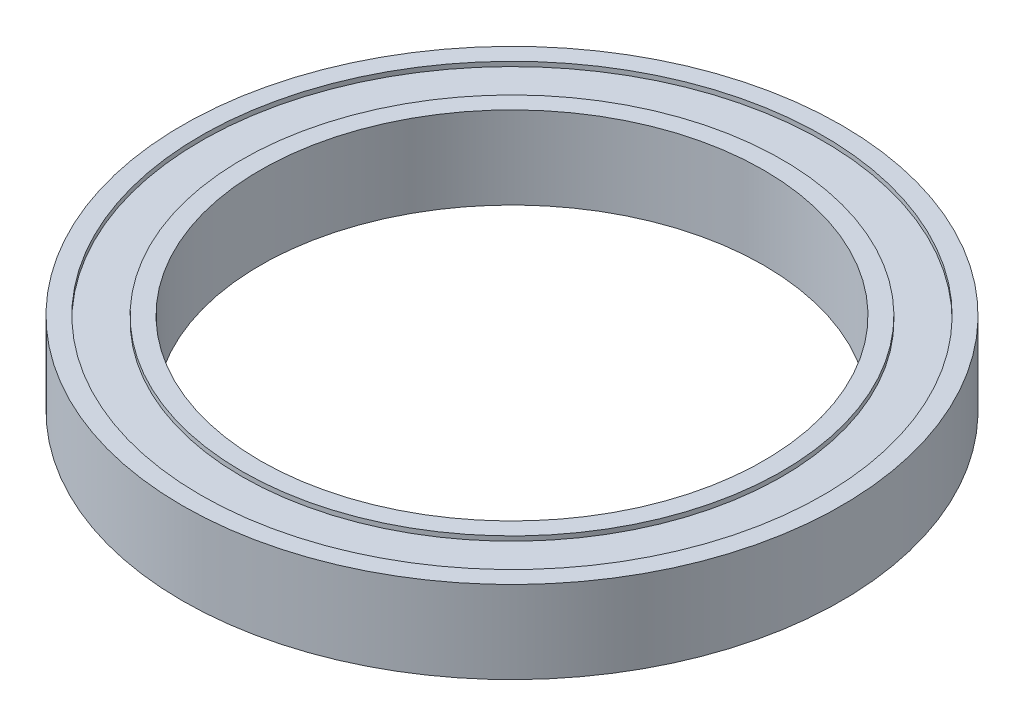
ISO-10303-21;
HEADER;
FILE_DESCRIPTION(('STEP AP214'),'2;1');
FILE_NAME('part.step','',(''),(''),'','','');
FILE_SCHEMA(('AUTOMOTIVE_DESIGN { 1 0 10303 214 1 1 1 1 }'));
ENDSEC;
DATA;
#1=APPLICATION_CONTEXT('core data for automotive mechanical design processes');
#2=APPLICATION_PROTOCOL_DEFINITION('international standard','automotive_design',2000,#1);
#3=PRODUCT_CONTEXT('',#1,'mechanical');
#4=PRODUCT('Part','Part','',(#3));
#5=PRODUCT_RELATED_PRODUCT_CATEGORY('part','',(#4));
#6=PRODUCT_DEFINITION_FORMATION('','',#4);
#7=PRODUCT_DEFINITION_CONTEXT('part definition',#1,'design');
#8=PRODUCT_DEFINITION('design','',#6,#7);
#9=PRODUCT_DEFINITION_SHAPE('','',#8);
#10=(LENGTH_UNIT() NAMED_UNIT(*) SI_UNIT(.MILLI.,.METRE.));
#11=(NAMED_UNIT(*) PLANE_ANGLE_UNIT() SI_UNIT($,.RADIAN.));
#12=(NAMED_UNIT(*) SI_UNIT($,.STERADIAN.) SOLID_ANGLE_UNIT());
#13=UNCERTAINTY_MEASURE_WITH_UNIT(LENGTH_MEASURE(1.E-05),#10,'distance_accuracy_value','');
#14=(GEOMETRIC_REPRESENTATION_CONTEXT(3) GLOBAL_UNCERTAINTY_ASSIGNED_CONTEXT((#13)) GLOBAL_UNIT_ASSIGNED_CONTEXT((#10,
#11,#12)) REPRESENTATION_CONTEXT('',''));
#15=CARTESIAN_POINT('',(0.,0.,0.));
#16=DIRECTION('',(0.,0.,1.));
#17=DIRECTION('',(1.,0.,0.));
#18=AXIS2_PLACEMENT_3D('',#15,#16,#17);
#19=CARTESIAN_POINT('',(0.,-4.5,0.));
#20=DIRECTION('',(0.,1.,0.));
#21=DIRECTION('',(0.,0.,1.));
#22=AXIS2_PLACEMENT_3D('',#19,#20,#21);
#23=PLANE('',#22);
#24=CARTESIAN_POINT('',(0.,-4.5,0.));
#25=DIRECTION('',(0.,1.,0.));
#26=DIRECTION('',(0.,0.,1.));
#27=AXIS2_PLACEMENT_3D('',#24,#25,#26);
#28=CIRCLE('',#27,27.5);
#29=CARTESIAN_POINT('',(0.,-4.5,27.5));
#30=VERTEX_POINT('',#29);
#31=EDGE_CURVE('E52',#30,#30,#28,.T.);
#32=ORIENTED_EDGE('',*,*,#31,.T.);
#33=EDGE_LOOP('',(#32));
#34=FACE_BOUND('',#33,.T.);
#35=CARTESIAN_POINT('',(0.,-4.5,0.));
#36=DIRECTION('',(0.,1.,0.));
#37=DIRECTION('',(0.,0.,1.));
#38=AXIS2_PLACEMENT_3D('',#35,#36,#37);
#39=CIRCLE('',#38,29.5);
#40=CARTESIAN_POINT('',(0.,-4.5,29.5));
#41=VERTEX_POINT('',#40);
#42=EDGE_CURVE('E76',#41,#41,#39,.T.);
#43=ORIENTED_EDGE('',*,*,#42,.F.);
#44=EDGE_LOOP('',(#43));
#45=FACE_BOUND('',#44,.T.);
#46=ADVANCED_FACE('F39',(#34,#45),#23,.F.);
#47=CARTESIAN_POINT('',(0.,4.5,0.));
#48=DIRECTION('',(0.,1.,0.));
#49=DIRECTION('',(0.,0.,1.));
#50=AXIS2_PLACEMENT_3D('',#47,#48,#49);
#51=PLANE('',#50);
#52=CARTESIAN_POINT('',(0.,4.5,0.));
#53=DIRECTION('',(0.,1.,0.));
#54=DIRECTION('',(0.,0.,1.));
#55=AXIS2_PLACEMENT_3D('',#52,#53,#54);
#56=CIRCLE('',#55,27.5);
#57=CARTESIAN_POINT('',(0.,4.5,27.5));
#58=VERTEX_POINT('',#57);
#59=EDGE_CURVE('E50',#58,#58,#56,.T.);
#60=ORIENTED_EDGE('',*,*,#59,.F.);
#61=EDGE_LOOP('',(#60));
#62=FACE_BOUND('',#61,.T.);
#63=CARTESIAN_POINT('',(0.,4.5,0.));
#64=DIRECTION('',(0.,1.,0.));
#65=DIRECTION('',(0.,0.,1.));
#66=AXIS2_PLACEMENT_3D('',#63,#64,#65);
#67=CIRCLE('',#66,29.5);
#68=CARTESIAN_POINT('',(0.,4.5,29.5));
#69=VERTEX_POINT('',#68);
#70=EDGE_CURVE('E64',#69,#69,#67,.T.);
#71=ORIENTED_EDGE('',*,*,#70,.T.);
#72=EDGE_LOOP('',(#71));
#73=FACE_BOUND('',#72,.T.);
#74=ADVANCED_FACE('F92',(#62,#73),#51,.T.);
#75=CARTESIAN_POINT('',(0.,4.5,0.));
#76=DIRECTION('',(0.,1.,0.));
#77=DIRECTION('',(0.,0.,1.));
#78=AXIS2_PLACEMENT_3D('',#75,#76,#77);
#79=CIRCLE('',#78,34.);
#80=CARTESIAN_POINT('',(0.,4.5,34.));
#81=VERTEX_POINT('',#80);
#82=EDGE_CURVE('E58',#81,#81,#79,.T.);
#83=ORIENTED_EDGE('',*,*,#82,.F.);
#84=EDGE_LOOP('',(#83));
#85=FACE_BOUND('',#84,.T.);
#86=CARTESIAN_POINT('',(0.,4.5,0.));
#87=DIRECTION('',(0.,1.,0.));
#88=DIRECTION('',(0.,0.,1.));
#89=AXIS2_PLACEMENT_3D('',#86,#87,#88);
#90=CIRCLE('',#89,36.);
#91=CARTESIAN_POINT('',(0.,4.5,36.));
#92=VERTEX_POINT('',#91);
#93=EDGE_CURVE('E10',#92,#92,#90,.T.);
#94=ORIENTED_EDGE('',*,*,#93,.T.);
#95=EDGE_LOOP('',(#94));
#96=FACE_BOUND('',#95,.T.);
#97=ADVANCED_FACE('F98',(#85,#96),#51,.T.);
#98=CARTESIAN_POINT('',(0.,-4.5,0.));
#99=DIRECTION('',(0.,1.,0.));
#100=DIRECTION('',(0.,0.,1.));
#101=AXIS2_PLACEMENT_3D('',#98,#99,#100);
#102=CIRCLE('',#101,34.);
#103=CARTESIAN_POINT('',(0.,-4.5,34.));
#104=VERTEX_POINT('',#103);
#105=EDGE_CURVE('E70',#104,#104,#102,.T.);
#106=ORIENTED_EDGE('',*,*,#105,.T.);
#107=EDGE_LOOP('',(#106));
#108=FACE_BOUND('',#107,.T.);
#109=CARTESIAN_POINT('',(0.,-4.5,0.));
#110=DIRECTION('',(0.,1.,0.));
#111=DIRECTION('',(0.,0.,1.));
#112=AXIS2_PLACEMENT_3D('',#109,#110,#111);
#113=CIRCLE('',#112,36.);
#114=CARTESIAN_POINT('',(0.,-4.5,36.));
#115=VERTEX_POINT('',#114);
#116=EDGE_CURVE('E43',#115,#115,#113,.T.);
#117=ORIENTED_EDGE('',*,*,#116,.F.);
#118=EDGE_LOOP('',(#117));
#119=FACE_BOUND('',#118,.T.);
#120=ADVANCED_FACE('F94',(#108,#119),#23,.F.);
#121=CARTESIAN_POINT('',(0.,4.5,0.));
#122=DIRECTION('',(0.,-1.,0.));
#123=DIRECTION('',(0.,0.,-1.));
#124=AXIS2_PLACEMENT_3D('',#121,#122,#123);
#125=CYLINDRICAL_SURFACE('',#124,36.);
#126=ORIENTED_EDGE('',*,*,#93,.F.);
#127=EDGE_LOOP('',(#126));
#128=FACE_BOUND('',#127,.T.);
#129=ORIENTED_EDGE('',*,*,#116,.T.);
#130=EDGE_LOOP('',(#129));
#131=FACE_BOUND('',#130,.T.);
#132=ADVANCED_FACE('F41',(#128,#131),#125,.T.);
#133=CARTESIAN_POINT('',(0.,4.5,0.));
#134=DIRECTION('',(0.,-1.,0.));
#135=DIRECTION('',(0.,0.,-1.));
#136=AXIS2_PLACEMENT_3D('',#133,#134,#135);
#137=CYLINDRICAL_SURFACE('',#136,27.5);
#138=ORIENTED_EDGE('',*,*,#59,.T.);
#139=EDGE_LOOP('',(#138));
#140=FACE_BOUND('',#139,.T.);
#141=ORIENTED_EDGE('',*,*,#31,.F.);
#142=EDGE_LOOP('',(#141));
#143=FACE_BOUND('',#142,.T.);
#144=ADVANCED_FACE('F107',(#140,#143),#137,.F.);
#145=CARTESIAN_POINT('',(0.,4.,0.));
#146=DIRECTION('',(0.,1.,0.));
#147=DIRECTION('',(0.,0.,1.));
#148=AXIS2_PLACEMENT_3D('',#145,#146,#147);
#149=CYLINDRICAL_SURFACE('',#148,34.);
#150=CARTESIAN_POINT('',(0.,4.,0.));
#151=DIRECTION('',(0.,1.,0.));
#152=DIRECTION('',(0.,0.,1.));
#153=AXIS2_PLACEMENT_3D('',#150,#151,#152);
#154=CIRCLE('',#153,34.);
#155=CARTESIAN_POINT('',(0.,4.,34.));
#156=VERTEX_POINT('',#155);
#157=EDGE_CURVE('E55',#156,#156,#154,.T.);
#158=ORIENTED_EDGE('',*,*,#157,.F.);
#159=EDGE_LOOP('',(#158));
#160=FACE_BOUND('',#159,.T.);
#161=ORIENTED_EDGE('',*,*,#82,.T.);
#162=EDGE_LOOP('',(#161));
#163=FACE_BOUND('',#162,.T.);
#164=ADVANCED_FACE('F131',(#160,#163),#149,.F.);
#165=CARTESIAN_POINT('',(0.,4.,0.));
#166=DIRECTION('',(0.,1.,0.));
#167=DIRECTION('',(0.,0.,1.));
#168=AXIS2_PLACEMENT_3D('',#165,#166,#167);
#169=PLANE('',#168);
#170=CARTESIAN_POINT('',(0.,4.,0.));
#171=DIRECTION('',(0.,1.,0.));
#172=DIRECTION('',(0.,0.,1.));
#173=AXIS2_PLACEMENT_3D('',#170,#171,#172);
#174=CIRCLE('',#173,29.5);
#175=CARTESIAN_POINT('',(0.,4.,29.5));
#176=VERTEX_POINT('',#175);
#177=EDGE_CURVE('E61',#176,#176,#174,.T.);
#178=ORIENTED_EDGE('',*,*,#177,.F.);
#179=EDGE_LOOP('',(#178));
#180=FACE_BOUND('',#179,.T.);
#181=ORIENTED_EDGE('',*,*,#157,.T.);
#182=EDGE_LOOP('',(#181));
#183=FACE_BOUND('',#182,.T.);
#184=ADVANCED_FACE('F127',(#180,#183),#169,.T.);
#185=CARTESIAN_POINT('',(0.,4.,0.));
#186=DIRECTION('',(0.,1.,0.));
#187=DIRECTION('',(0.,0.,1.));
#188=AXIS2_PLACEMENT_3D('',#185,#186,#187);
#189=CYLINDRICAL_SURFACE('',#188,29.5);
#190=ORIENTED_EDGE('',*,*,#177,.T.);
#191=EDGE_LOOP('',(#190));
#192=FACE_BOUND('',#191,.T.);
#193=ORIENTED_EDGE('',*,*,#70,.F.);
#194=EDGE_LOOP('',(#193));
#195=FACE_BOUND('',#194,.T.);
#196=ADVANCED_FACE('F121',(#192,#195),#189,.T.);
#197=CARTESIAN_POINT('',(0.,-4.,0.));
#198=DIRECTION('',(0.,-1.,0.));
#199=DIRECTION('',(0.,0.,1.));
#200=AXIS2_PLACEMENT_3D('',#197,#198,#199);
#201=PLANE('',#200);
#202=CARTESIAN_POINT('',(0.,-4.,0.));
#203=DIRECTION('',(0.,1.,0.));
#204=DIRECTION('',(0.,0.,1.));
#205=AXIS2_PLACEMENT_3D('',#202,#203,#204);
#206=CIRCLE('',#205,34.);
#207=CARTESIAN_POINT('',(0.,-4.,34.));
#208=VERTEX_POINT('',#207);
#209=EDGE_CURVE('E67',#208,#208,#206,.T.);
#210=ORIENTED_EDGE('',*,*,#209,.F.);
#211=EDGE_LOOP('',(#210));
#212=FACE_BOUND('',#211,.T.);
#213=CARTESIAN_POINT('',(0.,-4.,0.));
#214=DIRECTION('',(0.,1.,0.));
#215=DIRECTION('',(0.,0.,1.));
#216=AXIS2_PLACEMENT_3D('',#213,#214,#215);
#217=CIRCLE('',#216,29.5);
#218=CARTESIAN_POINT('',(0.,-4.,29.5));
#219=VERTEX_POINT('',#218);
#220=EDGE_CURVE('E73',#219,#219,#217,.T.);
#221=ORIENTED_EDGE('',*,*,#220,.T.);
#222=EDGE_LOOP('',(#221));
#223=FACE_BOUND('',#222,.T.);
#224=ADVANCED_FACE('F82',(#212,#223),#201,.T.);
#225=CARTESIAN_POINT('',(0.,-4.,0.));
#226=DIRECTION('',(0.,-1.,0.));
#227=DIRECTION('',(0.,0.,-1.));
#228=AXIS2_PLACEMENT_3D('',#225,#226,#227);
#229=CYLINDRICAL_SURFACE('',#228,34.);
#230=ORIENTED_EDGE('',*,*,#209,.T.);
#231=EDGE_LOOP('',(#230));
#232=FACE_BOUND('',#231,.T.);
#233=ORIENTED_EDGE('',*,*,#105,.F.);
#234=EDGE_LOOP('',(#233));
#235=FACE_BOUND('',#234,.T.);
#236=ADVANCED_FACE('F87',(#232,#235),#229,.F.);
#237=CARTESIAN_POINT('',(0.,-4.,0.));
#238=DIRECTION('',(0.,-1.,0.));
#239=DIRECTION('',(0.,0.,-1.));
#240=AXIS2_PLACEMENT_3D('',#237,#238,#239);
#241=CYLINDRICAL_SURFACE('',#240,29.5);
#242=ORIENTED_EDGE('',*,*,#220,.F.);
#243=EDGE_LOOP('',(#242));
#244=FACE_BOUND('',#243,.T.);
#245=ORIENTED_EDGE('',*,*,#42,.T.);
#246=EDGE_LOOP('',(#245));
#247=FACE_BOUND('',#246,.T.);
#248=ADVANCED_FACE('F84',(#244,#247),#241,.T.);
#249=CLOSED_SHELL('',(#46,#74,#97,#120,#132,#144,#164,#184,#196,#224,#236,#248));
#250=MANIFOLD_SOLID_BREP('B2',#249);
#251=ADVANCED_BREP_SHAPE_REPRESENTATION('',(#18,#250),#14);
#252=SHAPE_DEFINITION_REPRESENTATION(#9,#251);
ENDSEC;
END-ISO-10303-21;
